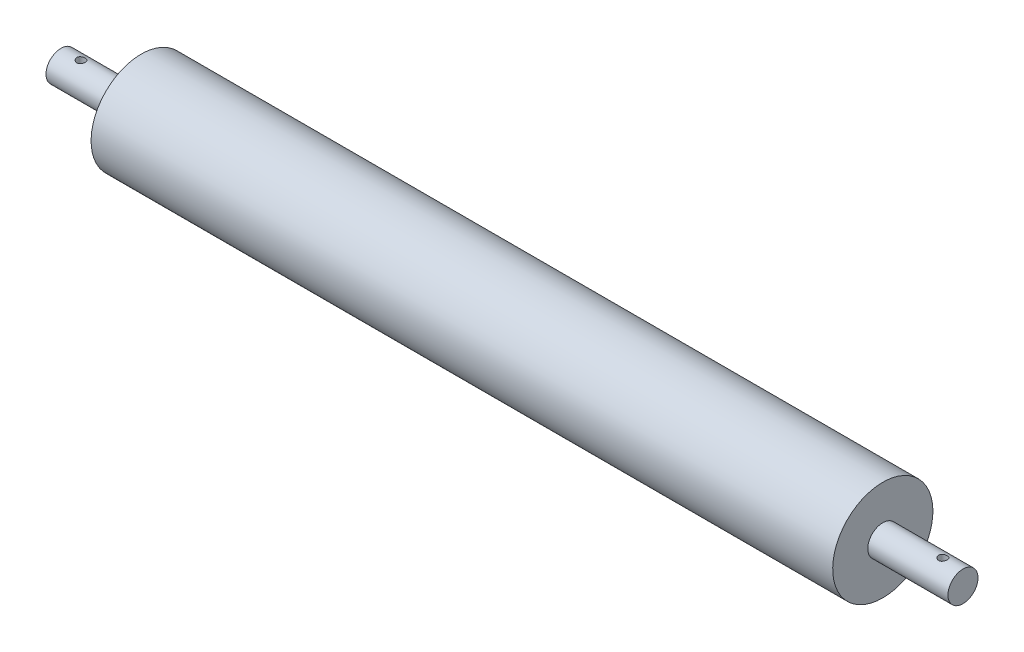
ISO-10303-21;
HEADER;
FILE_DESCRIPTION(('STEP AP214'),'2;1');
FILE_NAME('part.step','',(''),(''),'','','');
FILE_SCHEMA(('AUTOMOTIVE_DESIGN { 1 0 10303 214 1 1 1 1 }'));
ENDSEC;
DATA;
#1=APPLICATION_CONTEXT('core data for automotive mechanical design processes');
#2=APPLICATION_PROTOCOL_DEFINITION('international standard','automotive_design',2000,#1);
#3=PRODUCT_CONTEXT('',#1,'mechanical');
#4=PRODUCT('Part','Part','',(#3));
#5=PRODUCT_RELATED_PRODUCT_CATEGORY('part','',(#4));
#6=PRODUCT_DEFINITION_FORMATION('','',#4);
#7=PRODUCT_DEFINITION_CONTEXT('part definition',#1,'design');
#8=PRODUCT_DEFINITION('design','',#6,#7);
#9=PRODUCT_DEFINITION_SHAPE('','',#8);
#10=(LENGTH_UNIT() NAMED_UNIT(*) SI_UNIT(.MILLI.,.METRE.));
#11=(NAMED_UNIT(*) PLANE_ANGLE_UNIT() SI_UNIT($,.RADIAN.));
#12=(NAMED_UNIT(*) SI_UNIT($,.STERADIAN.) SOLID_ANGLE_UNIT());
#13=UNCERTAINTY_MEASURE_WITH_UNIT(LENGTH_MEASURE(1.E-05),#10,'distance_accuracy_value','');
#14=(GEOMETRIC_REPRESENTATION_CONTEXT(3) GLOBAL_UNCERTAINTY_ASSIGNED_CONTEXT((#13)) GLOBAL_UNIT_ASSIGNED_CONTEXT((#10,
#11,#12)) REPRESENTATION_CONTEXT('',''));
#15=CARTESIAN_POINT('',(0.,0.,0.));
#16=DIRECTION('',(0.,0.,1.));
#17=DIRECTION('',(1.,0.,0.));
#18=AXIS2_PLACEMENT_3D('',#15,#16,#17);
#19=CARTESIAN_POINT('',(-225.,0.,0.));
#20=DIRECTION('',(-1.,0.,0.));
#21=DIRECTION('',(0.,-1.,0.));
#22=AXIS2_PLACEMENT_3D('',#19,#20,#21);
#23=CYLINDRICAL_SURFACE('',#22,7.50000000000005);
#24=CARTESIAN_POINT('',(-212.9,-7.50000000000011,0.));
#25=CARTESIAN_POINT('',(-212.900002265932,-7.49999850044554,-0.115549071859457));
#26=CARTESIAN_POINT('',(-212.909568701615,-7.49730368858131,-0.231121705110066));
#27=CARTESIAN_POINT('',(-212.947505082606,-7.4868158263675,-0.45892349563475));
#28=CARTESIAN_POINT('',(-212.975882733424,-7.47902068682232,-0.571151263080411));
#29=CARTESIAN_POINT('',(-213.050435979883,-7.45919014801406,-0.788943238195502));
#30=CARTESIAN_POINT('',(-213.096587328513,-7.44716052737571,-0.894516296930381));
#31=CARTESIAN_POINT('',(-213.205284268175,-7.4201241503911,-1.09642476541401));
#32=CARTESIAN_POINT('',(-213.267831387487,-7.40511711654656,-1.19275931288064));
#33=CARTESIAN_POINT('',(-213.40921685869,-7.37331332850805,-1.37589761639295));
#34=CARTESIAN_POINT('',(-213.48839417191,-7.35648356700862,-1.46243395483418));
#35=CARTESIAN_POINT('',(-213.660068766112,-7.32313712362275,-1.62118994975328));
#36=CARTESIAN_POINT('',(-213.752567951364,-7.30662048687797,-1.69340755595235));
#37=CARTESIAN_POINT('',(-213.950444488171,-7.27542837897233,-1.82281954418508));
#38=CARTESIAN_POINT('',(-214.056034894758,-7.26079431852533,-1.87969906189856));
#39=CARTESIAN_POINT('',(-214.275756949843,-7.23551274440873,-1.97478943248911));
#40=CARTESIAN_POINT('',(-214.389886836729,-7.22486441122804,-2.01300412356117));
#41=CARTESIAN_POINT('',(-214.620469828537,-7.20910195955097,-2.06873752873863));
#42=CARTESIAN_POINT('',(-214.736795828738,-7.20385758469805,-2.08674433574881));
#43=CARTESIAN_POINT('',(-214.970926755648,-7.19910829329393,-2.10307354988687));
#44=CARTESIAN_POINT('',(-215.08873136992,-7.19960218395822,-2.10140004786117));
#45=CARTESIAN_POINT('',(-215.318605561201,-7.20615747477856,-2.07880203719542));
#46=CARTESIAN_POINT('',(-215.430739706368,-7.21204577982261,-2.05847601372619));
#47=CARTESIAN_POINT('',(-215.649938535122,-7.22844816907833,-2.0001117380616));
#48=CARTESIAN_POINT('',(-215.757002775789,-7.2389626566229,-1.96207194147719));
#49=CARTESIAN_POINT('',(-215.964545229844,-7.26357938222872,-1.86889065894201));
#50=CARTESIAN_POINT('',(-216.064926763074,-7.27772396889451,-1.81354549979213));
#51=CARTESIAN_POINT('',(-216.255184393326,-7.30798533076015,-1.68746638599932));
#52=CARTESIAN_POINT('',(-216.345058227229,-7.32410252929108,-1.61672912560206));
#53=CARTESIAN_POINT('',(-216.515159392371,-7.35720651544567,-1.45884755286447));
#54=CARTESIAN_POINT('',(-216.594920991732,-7.37420368441491,-1.37120287335204));
#55=CARTESIAN_POINT('',(-216.73871469503,-7.40663279030209,-1.18357169751813));
#56=CARTESIAN_POINT('',(-216.802746046709,-7.42206465234263,-1.08358461129687));
#57=CARTESIAN_POINT('',(-216.913496191882,-7.44973605200337,-0.873337450332554));
#58=CARTESIAN_POINT('',(-216.960123372682,-7.4619585991163,-0.763026733669732));
#59=CARTESIAN_POINT('',(-217.034032661246,-7.48171171416268,-0.535710183719804));
#60=CARTESIAN_POINT('',(-217.061319445106,-7.48924341618894,-0.418705976174556));
#61=CARTESIAN_POINT('',(-217.095025123087,-7.49859164706711,-0.185292401498512));
#62=CARTESIAN_POINT('',(-217.102076408542,-7.50058131296805,-0.0689811489871551));
#63=CARTESIAN_POINT('',(-217.096867443294,-7.49912299982246,0.163164639318449));
#64=CARTESIAN_POINT('',(-217.084609410336,-7.49567564523723,0.278999228327256));
#65=CARTESIAN_POINT('',(-217.041645897512,-7.48384311833665,0.504596268732437));
#66=CARTESIAN_POINT('',(-217.011299647587,-7.47555416236058,0.614432648474346));
#67=CARTESIAN_POINT('',(-216.933444075017,-7.4549851125705,0.827440079594221));
#68=CARTESIAN_POINT('',(-216.885932802633,-7.44270456537575,0.930610372215065));
#69=CARTESIAN_POINT('',(-216.773966485027,-7.41511700690716,1.12976408663138));
#70=CARTESIAN_POINT('',(-216.709176008197,-7.39975176074424,1.22555065053479));
#71=CARTESIAN_POINT('',(-216.564906489663,-7.36776719837975,1.40511158541059));
#72=CARTESIAN_POINT('',(-216.485424240599,-7.35114760881216,1.48888332632157));
#73=CARTESIAN_POINT('',(-216.311066544101,-7.31787944351917,1.64474908309544));
#74=CARTESIAN_POINT('',(-216.215786952467,-7.30124626249013,1.71639518266253));
#75=CARTESIAN_POINT('',(-216.014200243831,-7.27039890541735,1.84269980125679));
#76=CARTESIAN_POINT('',(-215.907893539075,-7.25618463899522,1.89735895503361));
#77=CARTESIAN_POINT('',(-215.687743301334,-7.23195038062162,1.98773352270874));
#78=CARTESIAN_POINT('',(-215.573945104113,-7.22190744096211,2.0235528782643));
#79=CARTESIAN_POINT('',(-215.341606782674,-7.20716859474255,2.07544269963815));
#80=CARTESIAN_POINT('',(-215.223068034976,-7.20247114750873,2.09151885593221));
#81=CARTESIAN_POINT('',(-214.98922436315,-7.19909300510946,2.103114655158));
#82=CARTESIAN_POINT('',(-214.873957874357,-7.20020048759666,2.09935796340977));
#83=CARTESIAN_POINT('',(-214.645772102506,-7.20780629176393,2.07309224060163));
#84=CARTESIAN_POINT('',(-214.532852746951,-7.21430444668282,2.05058378962983));
#85=CARTESIAN_POINT('',(-214.313582306345,-7.23182691657997,1.98789228158043));
#86=CARTESIAN_POINT('',(-214.207179451938,-7.24280810607189,1.94787737568999));
#87=CARTESIAN_POINT('',(-214.00251439703,-7.26805665519039,1.85143886377056));
#88=CARTESIAN_POINT('',(-213.904253592587,-7.28232457679056,1.79501245122783));
#89=CARTESIAN_POINT('',(-213.715244408188,-7.31311239075342,1.66522213518896));
#90=CARTESIAN_POINT('',(-213.624839592268,-7.32968998213815,1.59137155804019));
#91=CARTESIAN_POINT('',(-213.457470933722,-7.36292421204924,1.42973554613915));
#92=CARTESIAN_POINT('',(-213.380510442848,-7.37958086922708,1.3419466468612));
#93=CARTESIAN_POINT('',(-213.240364820534,-7.41158138369401,1.15235163570582));
#94=CARTESIAN_POINT('',(-213.177560154721,-7.42688347042859,1.05025658819516));
#95=CARTESIAN_POINT('',(-213.070102083336,-7.45397802038311,0.836529392791815));
#96=CARTESIAN_POINT('',(-213.02543822038,-7.46577250453018,0.724902784475287));
#97=CARTESIAN_POINT('',(-212.960661009321,-7.48318647397423,0.511578272572154));
#98=CARTESIAN_POINT('',(-212.937969244407,-7.48944328125714,0.410708274492533));
#99=CARTESIAN_POINT('',(-212.907638647024,-7.49785046352118,0.206564929983068));
#100=CARTESIAN_POINT('',(-212.899997974433,-7.5000013404852,0.10329187890855));
#101=CARTESIAN_POINT('',(-212.9,-7.50000000000011,0.));
#102=B_SPLINE_CURVE_WITH_KNOTS('',3,(#24,#25,#26,#27,#28,#29,#30,#31,#32,#33,#34,#35,#36,#37,
#38,#39,#40,#41,#42,#43,#44,#45,#46,#47,#48,#49,#50,#51,#52,#53,#54,#55,#56,#57,#58,#59,#60,#61,
#62,#63,#64,#65,#66,#67,#68,#69,#70,#71,#72,#73,#74,#75,#76,#77,#78,#79,#80,#81,#82,#83,#84,#85,
#86,#87,#88,#89,#90,#91,#92,#93,#94,#95,#96,#97,#98,#99,#100,#101),.UNSPECIFIED.,.T.,.F.,(4,2,2,
2,2,2,2,2,2,2,2,2,2,2,2,2,2,2,2,2,2,2,2,2,2,2,2,2,2,2,2,2,2,2,2,2,2,2,4),(0.,0.346268182086729,
0.692678291376706,1.03861748991142,1.38458894553261,1.7384494699132,2.09236062654245,
2.45306282264885,2.81369081346567,3.165407138292,3.51705035491517,3.85779089256616,
4.19856114350903,4.54350342442872,4.88851986168953,5.24599927407035,5.60349577863914,
5.96284840125165,6.32211411040286,6.67002301614659,7.01789196621452,7.35907226789233,
7.70029133572953,8.04868889915353,8.39716261126658,8.75655041081177,9.11592477953092,
9.47329506480391,9.83056232297602,10.1748857034314,10.5191984325935,10.8602742217546,
11.2014083722408,11.5535216990376,11.9057226849497,12.2664877844676,12.627044622426,
12.9366192831129,13.2461560933912),.UNSPECIFIED.);
#103=CARTESIAN_POINT('',(-212.9,-7.50000000000011,0.));
#104=VERTEX_POINT('',#103);
#105=EDGE_CURVE('E56',#104,#104,#102,.T.);
#106=ORIENTED_EDGE('',*,*,#105,.T.);
#107=EDGE_LOOP('',(#106));
#108=FACE_BOUND('',#107,.T.);
#109=CARTESIAN_POINT('',(-215.,7.20000000000001,-2.09999999999998));
#110=CARTESIAN_POINT('',(-214.884551105171,7.20000175092611,-2.09999769142369));
#111=CARTESIAN_POINT('',(-214.769078575321,7.20280713265304,-2.09044725800798));
#112=CARTESIAN_POINT('',(-214.54148428755,7.21368770991474,-2.05258019102822));
#113=CARTESIAN_POINT('',(-214.429364011186,7.22176520052276,-2.02425538445369));
#114=CARTESIAN_POINT('',(-214.211800239884,7.24220502233454,-1.9498565203188));
#115=CARTESIAN_POINT('',(-214.106346976187,7.25456090412265,-1.90380916683964));
#116=CARTESIAN_POINT('',(-213.904642076066,7.28215690109495,-1.79535769220002));
#117=CARTESIAN_POINT('',(-213.808391419824,7.29739732300138,-1.73295183131603));
#118=CARTESIAN_POINT('',(-213.625170524164,7.32951618449188,-1.59171413202464));
#119=CARTESIAN_POINT('',(-213.538491554078,7.3464259933653,-1.51251149606309));
#120=CARTESIAN_POINT('',(-213.379456847992,7.37970866753021,-1.34072490285873));
#121=CARTESIAN_POINT('',(-213.307102728488,7.39608147204939,-1.24813943745965));
#122=CARTESIAN_POINT('',(-213.177537651625,7.42679785762245,-1.05017536418179));
#123=CARTESIAN_POINT('',(-213.12061913539,7.44110013563313,-0.944598390212231));
#124=CARTESIAN_POINT('',(-213.025453091768,7.46570231446394,-0.724904746771338));
#125=CARTESIAN_POINT('',(-212.987202079501,7.4760029622418,-0.610789675797211));
#126=CARTESIAN_POINT('',(-212.931407724742,7.49121941354851,-0.380302236373013));
#127=CARTESIAN_POINT('',(-212.913368239384,7.49626401123117,-0.264058623362744));
#128=CARTESIAN_POINT('',(-212.896945021266,7.50085154395726,-0.0300927460087981));
#129=CARTESIAN_POINT('',(-212.898557674752,7.50039549049382,0.0876292425050895));
#130=CARTESIAN_POINT('',(-212.92104988332,7.49412619131461,0.317746311518642));
#131=CARTESIAN_POINT('',(-212.941392939667,7.48846212582118,0.430198522887043));
#132=CARTESIAN_POINT('',(-212.999898039308,7.47259127690994,0.650024177765268));
#133=CARTESIAN_POINT('',(-213.038061147435,7.4623842220287,0.757397317354186));
#134=CARTESIAN_POINT('',(-213.131515393555,7.43835884069074,0.965349801263539));
#135=CARTESIAN_POINT('',(-213.186984449305,7.42450324668395,1.06584470618677));
#136=CARTESIAN_POINT('',(-213.313337959938,7.39466485562083,1.2562786245792));
#137=CARTESIAN_POINT('',(-213.384225680743,7.37868160817165,1.34621539544037));
#138=CARTESIAN_POINT('',(-213.542227543553,7.34567522057905,1.51618305590155));
#139=CARTESIAN_POINT('',(-213.629808584103,7.32863518998309,1.59577717509014));
#140=CARTESIAN_POINT('',(-213.817248686452,7.29591665217891,1.73926156835207));
#141=CARTESIAN_POINT('',(-213.917108663539,7.28023824661686,1.80315067068667));
#142=CARTESIAN_POINT('',(-214.127296669996,7.25194501002576,1.9137903023159));
#143=CARTESIAN_POINT('',(-214.237696705722,7.23935371206725,1.96041048527217));
#144=CARTESIAN_POINT('',(-214.465210552784,7.21894665875122,2.03427979371575));
#145=CARTESIAN_POINT('',(-214.582322490633,7.21112957780356,2.0615342965447));
#146=CARTESIAN_POINT('',(-214.815822653963,7.20144181427927,2.0951213370356));
#147=CARTESIAN_POINT('',(-214.93210882732,7.19938465899453,2.10211023295228));
#148=CARTESIAN_POINT('',(-215.164190679021,7.20093733719562,2.09678562260949));
#149=CARTESIAN_POINT('',(-215.279986414098,7.20454649620962,2.08447441367737));
#150=CARTESIAN_POINT('',(-215.505192111961,7.21684386770043,2.04148011473317));
#151=CARTESIAN_POINT('',(-215.614686177437,7.22541993924817,2.01120230768186));
#152=CARTESIAN_POINT('',(-215.827038759286,7.24657269498034,1.93359543214542));
#153=CARTESIAN_POINT('',(-215.929896342924,7.2591499400491,1.88626397295674));
#154=CARTESIAN_POINT('',(-216.128772697618,7.28726240690147,1.77459509136295));
#155=CARTESIAN_POINT('',(-216.224569166007,7.30286116048027,1.7098781350204));
#156=CARTESIAN_POINT('',(-216.404183146438,7.33511474861878,1.56573803326783));
#157=CARTESIAN_POINT('',(-216.48799816133,7.35176980228926,1.48631183008105));
#158=CARTESIAN_POINT('',(-216.644050836574,7.38490975407121,1.31195238316688));
#159=CARTESIAN_POINT('',(-216.715827769497,7.4013718288206,1.21660153256647));
#160=CARTESIAN_POINT('',(-216.842362955699,7.43172364179825,1.01482822512431));
#161=CARTESIAN_POINT('',(-216.897122108126,7.44561351591507,0.908406353625252));
#162=CARTESIAN_POINT('',(-216.987549235114,7.46916678636433,0.688255620931217));
#163=CARTESIAN_POINT('',(-217.023361596398,7.47886204186584,0.574589642969954));
#164=CARTESIAN_POINT('',(-217.075281788541,7.4930742926061,0.342537614831916));
#165=CARTESIAN_POINT('',(-217.091394471009,7.49759256280785,0.224152734238785));
#166=CARTESIAN_POINT('',(-217.10312839472,7.50087475153957,-0.00969112124069943));
#167=CARTESIAN_POINT('',(-217.099422304045,7.49982757425403,-0.125114144970984));
#168=CARTESIAN_POINT('',(-217.073203611385,7.49253071356722,-0.353626881036647));
#169=CARTESIAN_POINT('',(-217.050691848555,7.48628126230442,-0.46671669725483));
#170=CARTESIAN_POINT('',(-216.987896139583,7.46932613881606,-0.686456269375127));
#171=CARTESIAN_POINT('',(-216.947760954317,7.4586578085919,-0.793151611784442));
#172=CARTESIAN_POINT('',(-216.8509899872,7.43397489084363,-0.998353701041703));
#173=CARTESIAN_POINT('',(-216.794351719446,7.41995979924538,-1.09685921135805));
#174=CARTESIAN_POINT('',(-216.664283001771,7.38956927564246,-1.28596610763474));
#175=CARTESIAN_POINT('',(-216.59041564695,7.37313745973982,-1.37625788128735));
#176=CARTESIAN_POINT('',(-216.42879782154,7.3399740390093,-1.54339107601338));
#177=CARTESIAN_POINT('',(-216.341043575182,7.32324235374893,-1.62022882700917));
#178=CARTESIAN_POINT('',(-216.151512877718,7.29088892650895,-1.76018100811377));
#179=CARTESIAN_POINT('',(-216.04944137268,7.27530525828304,-1.82290552428639));
#180=CARTESIAN_POINT('',(-215.835778008759,7.24757503896699,-1.93021956053792));
#181=CARTESIAN_POINT('',(-215.724191806851,7.23542646383002,-1.97481976673696));
#182=CARTESIAN_POINT('',(-215.511017150351,7.21744457121271,-2.03947300884318));
#183=CARTESIAN_POINT('',(-215.410261761127,7.21095909202013,-2.06211391312518));
#184=CARTESIAN_POINT('',(-215.206343642914,7.20223632826998,-2.09237736458969));
#185=CARTESIAN_POINT('',(-215.103181260938,7.19999843512783,-2.10000206326625));
#186=CARTESIAN_POINT('',(-215.,7.20000000000001,-2.09999999999998));
#187=B_SPLINE_CURVE_WITH_KNOTS('',3,(#109,#110,#111,#112,#113,#114,#115,#116,#117,#118,#119,
#120,#121,#122,#123,#124,#125,#126,#127,#128,#129,#130,#131,#132,#133,#134,#135,#136,#137,#138,
#139,#140,#141,#142,#143,#144,#145,#146,#147,#148,#149,#150,#151,#152,#153,#154,#155,#156,#157,
#158,#159,#160,#161,#162,#163,#164,#165,#166,#167,#168,#169,#170,#171,#172,#173,#174,#175,#176,
#177,#178,#179,#180,#181,#182,#183,#184,#185,#186),.UNSPECIFIED.,.T.,.F.,(4,2,2,2,2,2,2,2,2,2,2,
2,2,2,2,2,2,2,2,2,2,2,2,2,2,2,2,2,2,2,2,2,2,2,2,2,2,2,4),(0.,0.345966820679471,
0.692084349409676,1.03768238213022,1.3833171840449,1.73757082880147,2.09186442676817,
2.45246381411616,2.81299585839307,3.16446935825169,3.51587822801509,3.85752460211592,
4.19919139381875,4.54449343533438,4.8898686887804,5.24690042870958,5.60395879841148,
5.96365984094946,6.32326096486549,6.67107770948498,7.0188530559746,7.35906666926097,
7.699327994706,8.04772451120087,8.39619353426622,8.75590447674838,9.1155964103904,
9.47250627059269,9.82932821384829,10.1741178008123,10.5188920032276,10.8608102624592,
11.202780052397,11.5546053491271,11.9065264700836,12.267221716464,12.627703986753,
12.9369525819905,13.2461568654393),.UNSPECIFIED.);
#188=CARTESIAN_POINT('',(-215.,7.20000000000001,-2.09999999999998));
#189=VERTEX_POINT('',#188);
#190=EDGE_CURVE('E74',#189,#189,#187,.T.);
#191=ORIENTED_EDGE('',*,*,#190,.T.);
#192=EDGE_LOOP('',(#191));
#193=FACE_BOUND('',#192,.T.);
#194=CARTESIAN_POINT('',(-225.,0.,0.));
#195=DIRECTION('',(-1.,0.,0.));
#196=DIRECTION('',(0.,-1.,0.));
#197=AXIS2_PLACEMENT_3D('',#194,#195,#196);
#198=CIRCLE('',#197,7.50000000000006);
#199=CARTESIAN_POINT('',(-225.,-7.50000000000011,0.));
#200=VERTEX_POINT('',#199);
#201=EDGE_CURVE('E134',#200,#200,#198,.T.);
#202=ORIENTED_EDGE('',*,*,#201,.F.);
#203=EDGE_LOOP('',(#202));
#204=FACE_BOUND('',#203,.T.);
#205=CARTESIAN_POINT('',(-185.,0.,0.));
#206=DIRECTION('',(-1.,0.,0.));
#207=DIRECTION('',(0.,-1.,0.));
#208=AXIS2_PLACEMENT_3D('',#205,#206,#207);
#209=CIRCLE('',#208,7.50000000000005);
#210=CARTESIAN_POINT('',(-185.,-7.5000000000001,0.));
#211=VERTEX_POINT('',#210);
#212=EDGE_CURVE('E61',#211,#211,#209,.T.);
#213=ORIENTED_EDGE('',*,*,#212,.T.);
#214=EDGE_LOOP('',(#213));
#215=FACE_BOUND('',#214,.T.);
#216=ADVANCED_FACE('F43',(#108,#193,#204,#215),#23,.T.);
#217=CARTESIAN_POINT('',(-185.,25.,0.));
#218=DIRECTION('',(1.,0.,0.));
#219=DIRECTION('',(0.,1.,0.));
#220=AXIS2_PLACEMENT_3D('',#217,#218,#219);
#221=PLANE('',#220);
#222=ORIENTED_EDGE('',*,*,#212,.F.);
#223=EDGE_LOOP('',(#222));
#224=FACE_BOUND('',#223,.T.);
#225=CARTESIAN_POINT('',(-185.,0.,0.));
#226=DIRECTION('',(-1.,0.,0.));
#227=DIRECTION('',(0.,-1.,0.));
#228=AXIS2_PLACEMENT_3D('',#225,#226,#227);
#229=CIRCLE('',#228,25.0000000000001);
#230=CARTESIAN_POINT('',(-185.,-25.0000000000001,0.));
#231=VERTEX_POINT('',#230);
#232=EDGE_CURVE('E67',#231,#231,#229,.T.);
#233=ORIENTED_EDGE('',*,*,#232,.T.);
#234=EDGE_LOOP('',(#233));
#235=FACE_BOUND('',#234,.T.);
#236=ADVANCED_FACE('F108',(#224,#235),#221,.F.);
#237=CARTESIAN_POINT('',(-225.,0.,0.));
#238=DIRECTION('',(-1.,0.,0.));
#239=DIRECTION('',(0.,-1.,0.));
#240=AXIS2_PLACEMENT_3D('',#237,#238,#239);
#241=CYLINDRICAL_SURFACE('',#240,25.);
#242=ORIENTED_EDGE('',*,*,#232,.F.);
#243=EDGE_LOOP('',(#242));
#244=FACE_BOUND('',#243,.T.);
#245=CARTESIAN_POINT('',(185.,0.,0.));
#246=DIRECTION('',(-1.,0.,0.));
#247=DIRECTION('',(0.,-1.,0.));
#248=AXIS2_PLACEMENT_3D('',#245,#246,#247);
#249=CIRCLE('',#248,25.);
#250=CARTESIAN_POINT('',(185.,-25.,0.));
#251=VERTEX_POINT('',#250);
#252=EDGE_CURVE('E120',#251,#251,#249,.T.);
#253=ORIENTED_EDGE('',*,*,#252,.T.);
#254=EDGE_LOOP('',(#253));
#255=FACE_BOUND('',#254,.T.);
#256=ADVANCED_FACE('F105',(#244,#255),#241,.T.);
#257=CARTESIAN_POINT('',(185.,25.,0.));
#258=DIRECTION('',(-1.,0.,0.));
#259=DIRECTION('',(0.,-1.,0.));
#260=AXIS2_PLACEMENT_3D('',#257,#258,#259);
#261=PLANE('',#260);
#262=ORIENTED_EDGE('',*,*,#252,.F.);
#263=EDGE_LOOP('',(#262));
#264=FACE_BOUND('',#263,.T.);
#265=CARTESIAN_POINT('',(185.,0.,0.));
#266=DIRECTION('',(-1.,0.,0.));
#267=DIRECTION('',(0.,-1.,0.));
#268=AXIS2_PLACEMENT_3D('',#265,#266,#267);
#269=CIRCLE('',#268,7.50000000000001);
#270=CARTESIAN_POINT('',(185.,-7.50000000000001,0.));
#271=VERTEX_POINT('',#270);
#272=EDGE_CURVE('E124',#271,#271,#269,.T.);
#273=ORIENTED_EDGE('',*,*,#272,.T.);
#274=EDGE_LOOP('',(#273));
#275=FACE_BOUND('',#274,.T.);
#276=ADVANCED_FACE('F101',(#264,#275),#261,.F.);
#277=CARTESIAN_POINT('',(-225.,0.,0.));
#278=DIRECTION('',(-1.,0.,0.));
#279=DIRECTION('',(0.,-1.,0.));
#280=AXIS2_PLACEMENT_3D('',#277,#278,#279);
#281=CYLINDRICAL_SURFACE('',#280,7.50000000000003);
#282=CARTESIAN_POINT('',(217.1,-7.50000000000003,0.));
#283=CARTESIAN_POINT('',(217.099997734068,-7.49999850044547,-0.115549071859457));
#284=CARTESIAN_POINT('',(217.090431298385,-7.49730368858123,-0.231121705110066));
#285=CARTESIAN_POINT('',(217.052494917394,-7.48681582636743,-0.45892349563475));
#286=CARTESIAN_POINT('',(217.024117266576,-7.47902068682225,-0.571151263080411));
#287=CARTESIAN_POINT('',(216.949564020117,-7.45919014801399,-0.788943238195502));
#288=CARTESIAN_POINT('',(216.903412671487,-7.44716052737563,-0.89451629693038));
#289=CARTESIAN_POINT('',(216.794715731825,-7.42012415039103,-1.09642476541401));
#290=CARTESIAN_POINT('',(216.732168612513,-7.40511711654648,-1.19275931288064));
#291=CARTESIAN_POINT('',(216.59078314131,-7.37331332850798,-1.37589761639295));
#292=CARTESIAN_POINT('',(216.51160582809,-7.35648356700855,-1.46243395483418));
#293=CARTESIAN_POINT('',(216.339931233888,-7.32313712362267,-1.62118994975328));
#294=CARTESIAN_POINT('',(216.247432048636,-7.30662048687789,-1.69340755595235));
#295=CARTESIAN_POINT('',(216.049555511829,-7.27542837897225,-1.82281954418508));
#296=CARTESIAN_POINT('',(215.943965105242,-7.26079431852525,-1.87969906189856));
#297=CARTESIAN_POINT('',(215.724243050157,-7.23551274440866,-1.97478943248911));
#298=CARTESIAN_POINT('',(215.610113163271,-7.22486441122796,-2.01300412356117));
#299=CARTESIAN_POINT('',(215.379530171463,-7.20910195955089,-2.06873752873863));
#300=CARTESIAN_POINT('',(215.263204171262,-7.20385758469797,-2.08674433574881));
#301=CARTESIAN_POINT('',(215.029073244352,-7.19910829329386,-2.10307354988687));
#302=CARTESIAN_POINT('',(214.91126863008,-7.19960218395814,-2.10140004786117));
#303=CARTESIAN_POINT('',(214.681394438799,-7.20615747477848,-2.07880203719542));
#304=CARTESIAN_POINT('',(214.569260293632,-7.21204577982253,-2.05847601372619));
#305=CARTESIAN_POINT('',(214.350061464878,-7.22844816907825,-2.0001117380616));
#306=CARTESIAN_POINT('',(214.242997224211,-7.23896265662282,-1.96207194147719));
#307=CARTESIAN_POINT('',(214.035454770156,-7.26357938222864,-1.86889065894201));
#308=CARTESIAN_POINT('',(213.935073236926,-7.27772396889443,-1.81354549979213));
#309=CARTESIAN_POINT('',(213.744815606674,-7.30798533076007,-1.68746638599933));
#310=CARTESIAN_POINT('',(213.654941772771,-7.32410252929101,-1.61672912560206));
#311=CARTESIAN_POINT('',(213.484840607629,-7.35720651544559,-1.45884755286447));
#312=CARTESIAN_POINT('',(213.405079008268,-7.37420368441483,-1.37120287335204));
#313=CARTESIAN_POINT('',(213.26128530497,-7.40663279030202,-1.18357169751813));
#314=CARTESIAN_POINT('',(213.197253953291,-7.42206465234255,-1.08358461129688));
#315=CARTESIAN_POINT('',(213.086503808118,-7.4497360520033,-0.87333745033256));
#316=CARTESIAN_POINT('',(213.039876627318,-7.46195859911622,-0.763026733669743));
#317=CARTESIAN_POINT('',(212.965967338754,-7.48171171416261,-0.535710183719823));
#318=CARTESIAN_POINT('',(212.938680554894,-7.48924341618886,-0.41870597617458));
#319=CARTESIAN_POINT('',(212.904974876913,-7.49859164706704,-0.185292401498535));
#320=CARTESIAN_POINT('',(212.897923591458,-7.50058131296797,-0.0689811489871725));
#321=CARTESIAN_POINT('',(212.903132556706,-7.49912299982238,0.163164639318441));
#322=CARTESIAN_POINT('',(212.915390589664,-7.49567564523715,0.278999228327252));
#323=CARTESIAN_POINT('',(212.958354102488,-7.48384311833657,0.504596268732447));
#324=CARTESIAN_POINT('',(212.988700352413,-7.47555416236051,0.614432648474365));
#325=CARTESIAN_POINT('',(213.066555924983,-7.45498511257042,0.827440079594238));
#326=CARTESIAN_POINT('',(213.114067197367,-7.44270456537568,0.930610372215072));
#327=CARTESIAN_POINT('',(213.226033514973,-7.41511700690709,1.12976408663138));
#328=CARTESIAN_POINT('',(213.290823991803,-7.39975176074416,1.22555065053479));
#329=CARTESIAN_POINT('',(213.435093510337,-7.36776719837967,1.40511158541059));
#330=CARTESIAN_POINT('',(213.514575759401,-7.35114760881209,1.48888332632156));
#331=CARTESIAN_POINT('',(213.688933455899,-7.31787944351909,1.64474908309543));
#332=CARTESIAN_POINT('',(213.784213047533,-7.30124626249006,1.71639518266252));
#333=CARTESIAN_POINT('',(213.985799756169,-7.27039890541727,1.84269980125679));
#334=CARTESIAN_POINT('',(214.092106460925,-7.25618463899515,1.89735895503361));
#335=CARTESIAN_POINT('',(214.312256698666,-7.23195038062154,1.98773352270874));
#336=CARTESIAN_POINT('',(214.426054895887,-7.22190744096203,2.0235528782643));
#337=CARTESIAN_POINT('',(214.658393217326,-7.20716859474247,2.07544269963815));
#338=CARTESIAN_POINT('',(214.776931965024,-7.20247114750865,2.09151885593221));
#339=CARTESIAN_POINT('',(215.01077563685,-7.19909300510939,2.103114655158));
#340=CARTESIAN_POINT('',(215.126042125643,-7.20020048759658,2.09935796340977));
#341=CARTESIAN_POINT('',(215.354227897494,-7.20780629176385,2.07309224060163));
#342=CARTESIAN_POINT('',(215.467147253049,-7.21430444668275,2.05058378962983));
#343=CARTESIAN_POINT('',(215.686417693655,-7.2318269165799,1.98789228158043));
#344=CARTESIAN_POINT('',(215.792820548062,-7.24280810607181,1.94787737568999));
#345=CARTESIAN_POINT('',(215.99748560297,-7.26805665519031,1.85143886377056));
#346=CARTESIAN_POINT('',(216.095746407413,-7.28232457679048,1.79501245122783));
#347=CARTESIAN_POINT('',(216.284755591812,-7.31311239075335,1.66522213518896));
#348=CARTESIAN_POINT('',(216.375160407732,-7.32968998213807,1.59137155804019));
#349=CARTESIAN_POINT('',(216.542529066278,-7.36292421204917,1.42973554613915));
#350=CARTESIAN_POINT('',(216.619489557152,-7.379580869227,1.3419466468612));
#351=CARTESIAN_POINT('',(216.759635179466,-7.41158138369394,1.15235163570582));
#352=CARTESIAN_POINT('',(216.822439845279,-7.42688347042852,1.05025658819516));
#353=CARTESIAN_POINT('',(216.929897916664,-7.45397802038304,0.836529392791816));
#354=CARTESIAN_POINT('',(216.97456177962,-7.4657725045301,0.724902784475288));
#355=CARTESIAN_POINT('',(217.039338990679,-7.48318647397415,0.511578272572155));
#356=CARTESIAN_POINT('',(217.062030755593,-7.48944328125707,0.410708274492533));
#357=CARTESIAN_POINT('',(217.092361352976,-7.49785046352111,0.206564929983068));
#358=CARTESIAN_POINT('',(217.100002025567,-7.50000134048513,0.10329187890855));
#359=CARTESIAN_POINT('',(217.1,-7.50000000000003,0.));
#360=B_SPLINE_CURVE_WITH_KNOTS('',3,(#282,#283,#284,#285,#286,#287,#288,#289,#290,#291,#292,
#293,#294,#295,#296,#297,#298,#299,#300,#301,#302,#303,#304,#305,#306,#307,#308,#309,#310,#311,
#312,#313,#314,#315,#316,#317,#318,#319,#320,#321,#322,#323,#324,#325,#326,#327,#328,#329,#330,
#331,#332,#333,#334,#335,#336,#337,#338,#339,#340,#341,#342,#343,#344,#345,#346,#347,#348,#349,
#350,#351,#352,#353,#354,#355,#356,#357,#358,#359),.UNSPECIFIED.,.T.,.F.,(4,2,2,2,2,2,2,2,2,2,2,
2,2,2,2,2,2,2,2,2,2,2,2,2,2,2,2,2,2,2,2,2,2,2,2,2,2,2,4),(0.,0.346268182086729,
0.692678291376706,1.03861748991142,1.38458894553261,1.7384494699132,2.09236062654245,
2.45306282264885,2.81369081346567,3.165407138292,3.51705035491517,3.85779089256616,
4.19856114350903,4.54350342442869,4.88851986168953,5.24599927407034,5.60349577863914,
5.96284840125162,6.32211411040283,6.67002301614657,7.01789196621452,7.35907226789235,
7.70029133572952,8.04868889915352,8.39716261126657,8.75655041081176,9.11592477953092,
9.4732950648039,9.83056232297602,10.1748857034314,10.5191984325935,10.8602742217546,
11.2014083722408,11.5535216990376,11.9057226849497,12.2664877844676,12.627044622426,
12.9366192831129,13.2461560933912),.UNSPECIFIED.);
#361=CARTESIAN_POINT('',(217.1,-7.50000000000003,0.));
#362=VERTEX_POINT('',#361);
#363=EDGE_CURVE('E10',#362,#362,#360,.T.);
#364=ORIENTED_EDGE('',*,*,#363,.T.);
#365=EDGE_LOOP('',(#364));
#366=FACE_BOUND('',#365,.T.);
#367=CARTESIAN_POINT('',(215.,7.20000000000004,-2.09999999999998));
#368=CARTESIAN_POINT('',(215.115448894829,7.20000175092614,-2.09999769142369));
#369=CARTESIAN_POINT('',(215.230921424679,7.20280713265307,-2.09044725800798));
#370=CARTESIAN_POINT('',(215.45851571245,7.21368770991477,-2.05258019102822));
#371=CARTESIAN_POINT('',(215.570635988814,7.22176520052279,-2.02425538445369));
#372=CARTESIAN_POINT('',(215.788199760116,7.24220502233456,-1.9498565203188));
#373=CARTESIAN_POINT('',(215.893653023813,7.25456090412268,-1.90380916683964));
#374=CARTESIAN_POINT('',(216.095357923934,7.28215690109498,-1.79535769220002));
#375=CARTESIAN_POINT('',(216.191608580176,7.29739732300141,-1.73295183131603));
#376=CARTESIAN_POINT('',(216.374829475836,7.32951618449191,-1.59171413202464));
#377=CARTESIAN_POINT('',(216.461508445922,7.34642599336533,-1.51251149606309));
#378=CARTESIAN_POINT('',(216.620543152008,7.37970866753024,-1.34072490285873));
#379=CARTESIAN_POINT('',(216.692897271512,7.39608147204942,-1.24813943745965));
#380=CARTESIAN_POINT('',(216.822462348375,7.42679785762248,-1.05017536418179));
#381=CARTESIAN_POINT('',(216.87938086461,7.44110013563316,-0.944598390212231));
#382=CARTESIAN_POINT('',(216.974546908232,7.46570231446397,-0.724904746771338));
#383=CARTESIAN_POINT('',(217.012797920499,7.47600296224183,-0.610789675797211));
#384=CARTESIAN_POINT('',(217.068592275258,7.49121941354854,-0.380302236373013));
#385=CARTESIAN_POINT('',(217.086631760616,7.49626401123119,-0.264058623362744));
#386=CARTESIAN_POINT('',(217.103054978734,7.50085154395729,-0.0300927460087985));
#387=CARTESIAN_POINT('',(217.101442325248,7.50039549049385,0.087629242505089));
#388=CARTESIAN_POINT('',(217.07895011668,7.49412619131464,0.317746311518641));
#389=CARTESIAN_POINT('',(217.058607060333,7.48846212582121,0.430198522887042));
#390=CARTESIAN_POINT('',(217.000101960692,7.47259127690997,0.650024177765267));
#391=CARTESIAN_POINT('',(216.961938852565,7.46238422202873,0.757397317354185));
#392=CARTESIAN_POINT('',(216.868484606445,7.43835884069077,0.965349801263538));
#393=CARTESIAN_POINT('',(216.813015550695,7.42450324668398,1.06584470618677));
#394=CARTESIAN_POINT('',(216.686662040062,7.39466485562086,1.2562786245792));
#395=CARTESIAN_POINT('',(216.615774319257,7.37868160817168,1.34621539544037));
#396=CARTESIAN_POINT('',(216.457772456447,7.34567522057908,1.51618305590155));
#397=CARTESIAN_POINT('',(216.370191415897,7.32863518998311,1.59577717509014));
#398=CARTESIAN_POINT('',(216.182751313548,7.29591665217894,1.73926156835207));
#399=CARTESIAN_POINT('',(216.082891336461,7.28023824661689,1.80315067068667));
#400=CARTESIAN_POINT('',(215.872703330004,7.25194501002579,1.9137903023159));
#401=CARTESIAN_POINT('',(215.762303294278,7.23935371206728,1.96041048527217));
#402=CARTESIAN_POINT('',(215.534789447216,7.21894665875125,2.03427979371575));
#403=CARTESIAN_POINT('',(215.417677509367,7.21112957780359,2.0615342965447));
#404=CARTESIAN_POINT('',(215.184177346037,7.2014418142793,2.0951213370356));
#405=CARTESIAN_POINT('',(215.06789117268,7.19938465899456,2.10211023295227));
#406=CARTESIAN_POINT('',(214.835809320979,7.20093733719565,2.09678562260949));
#407=CARTESIAN_POINT('',(214.720013585902,7.20454649620964,2.08447441367737));
#408=CARTESIAN_POINT('',(214.494807888039,7.21684386770046,2.04148011473317));
#409=CARTESIAN_POINT('',(214.385313822563,7.2254199392482,2.01120230768186));
#410=CARTESIAN_POINT('',(214.172961240714,7.24657269498037,1.93359543214542));
#411=CARTESIAN_POINT('',(214.070103657076,7.25914994004913,1.88626397295674));
#412=CARTESIAN_POINT('',(213.871227302382,7.28726240690149,1.77459509136296));
#413=CARTESIAN_POINT('',(213.775430833993,7.30286116048029,1.70987813502042));
#414=CARTESIAN_POINT('',(213.595816853562,7.33511474861881,1.56573803326785));
#415=CARTESIAN_POINT('',(213.51200183867,7.35176980228929,1.48631183008106));
#416=CARTESIAN_POINT('',(213.355949163426,7.38490975407124,1.31195238316688));
#417=CARTESIAN_POINT('',(213.284172230503,7.40137182882063,1.21660153256648));
#418=CARTESIAN_POINT('',(213.157637044301,7.43172364179828,1.01482822512432));
#419=CARTESIAN_POINT('',(213.102877891874,7.4456135159151,0.908406353625256));
#420=CARTESIAN_POINT('',(213.012450764886,7.46916678636436,0.688255620931216));
#421=CARTESIAN_POINT('',(212.976638403602,7.47886204186587,0.574589642969955));
#422=CARTESIAN_POINT('',(212.924718211459,7.49307429260613,0.342537614831916));
#423=CARTESIAN_POINT('',(212.908605528991,7.49759256280788,0.224152734238785));
#424=CARTESIAN_POINT('',(212.89687160528,7.5008747515396,-0.00969112124070149));
#425=CARTESIAN_POINT('',(212.900577695955,7.49982757425406,-0.125114144970989));
#426=CARTESIAN_POINT('',(212.926796388615,7.49253071356725,-0.353626881036651));
#427=CARTESIAN_POINT('',(212.949308151445,7.48628126230445,-0.466716697254831));
#428=CARTESIAN_POINT('',(213.012103860417,7.46932613881609,-0.686456269375126));
#429=CARTESIAN_POINT('',(213.052239045683,7.45865780859193,-0.793151611784441));
#430=CARTESIAN_POINT('',(213.1490100128,7.43397489084366,-0.998353701041702));
#431=CARTESIAN_POINT('',(213.205648280554,7.41995979924542,-1.09685921135805));
#432=CARTESIAN_POINT('',(213.335716998229,7.38956927564249,-1.28596610763474));
#433=CARTESIAN_POINT('',(213.40958435305,7.37313745973985,-1.37625788128735));
#434=CARTESIAN_POINT('',(213.57120217846,7.33997403900933,-1.54339107601338));
#435=CARTESIAN_POINT('',(213.658956424818,7.32324235374896,-1.62022882700917));
#436=CARTESIAN_POINT('',(213.848487122282,7.29088892650898,-1.76018100811378));
#437=CARTESIAN_POINT('',(213.95055862732,7.27530525828307,-1.8229055242864));
#438=CARTESIAN_POINT('',(214.164221991241,7.24757503896702,-1.93021956053792));
#439=CARTESIAN_POINT('',(214.275808193149,7.23542646383005,-1.97481976673696));
#440=CARTESIAN_POINT('',(214.488982849649,7.21744457121274,-2.03947300884318));
#441=CARTESIAN_POINT('',(214.589738238873,7.21095909202017,-2.06211391312517));
#442=CARTESIAN_POINT('',(214.793656357086,7.20223632827001,-2.09237736458969));
#443=CARTESIAN_POINT('',(214.896818739062,7.19999843512786,-2.10000206326625));
#444=CARTESIAN_POINT('',(215.,7.20000000000004,-2.09999999999998));
#445=B_SPLINE_CURVE_WITH_KNOTS('',3,(#367,#368,#369,#370,#371,#372,#373,#374,#375,#376,#377,
#378,#379,#380,#381,#382,#383,#384,#385,#386,#387,#388,#389,#390,#391,#392,#393,#394,#395,#396,
#397,#398,#399,#400,#401,#402,#403,#404,#405,#406,#407,#408,#409,#410,#411,#412,#413,#414,#415,
#416,#417,#418,#419,#420,#421,#422,#423,#424,#425,#426,#427,#428,#429,#430,#431,#432,#433,#434,
#435,#436,#437,#438,#439,#440,#441,#442,#443,#444),.UNSPECIFIED.,.T.,.F.,(4,2,2,2,2,2,2,2,2,2,2,
2,2,2,2,2,2,2,2,2,2,2,2,2,2,2,2,2,2,2,2,2,2,2,2,2,2,2,4),(0.,0.345966820679471,
0.692084349409676,1.03768238213022,1.3833171840449,1.73757082880147,2.09186442676817,
2.45246381411616,2.81299585839307,3.16446935825169,3.51587822801509,3.85752460211592,
4.19919139381875,4.54449343533438,4.88986868878039,5.24690042870957,5.60395879841148,
5.96365984094946,6.32326096486549,6.67107770948493,7.0188530559746,7.35906666926097,
7.699327994706,8.04772451120083,8.39619353426622,8.75590447674836,9.1155964103904,
9.47250627059269,9.82932821384829,10.1741178008123,10.5188920032276,10.8608102624592,
11.202780052397,11.5546053491271,11.9065264700836,12.267221716464,12.627703986753,
12.9369525819904,13.2461568654393),.UNSPECIFIED.);
#446=CARTESIAN_POINT('',(215.,7.20000000000004,-2.09999999999998));
#447=VERTEX_POINT('',#446);
#448=EDGE_CURVE('E78',#447,#447,#445,.T.);
#449=ORIENTED_EDGE('',*,*,#448,.T.);
#450=EDGE_LOOP('',(#449));
#451=FACE_BOUND('',#450,.T.);
#452=ORIENTED_EDGE('',*,*,#272,.F.);
#453=EDGE_LOOP('',(#452));
#454=FACE_BOUND('',#453,.T.);
#455=CARTESIAN_POINT('',(225.,0.,0.));
#456=DIRECTION('',(-1.,0.,0.));
#457=DIRECTION('',(0.,-1.,0.));
#458=AXIS2_PLACEMENT_3D('',#455,#456,#457);
#459=CIRCLE('',#458,7.50000000000006);
#460=CARTESIAN_POINT('',(225.,-7.50000000000006,0.));
#461=VERTEX_POINT('',#460);
#462=EDGE_CURVE('E130',#461,#461,#459,.T.);
#463=ORIENTED_EDGE('',*,*,#462,.T.);
#464=EDGE_LOOP('',(#463));
#465=FACE_BOUND('',#464,.T.);
#466=ADVANCED_FACE('F96',(#366,#451,#454,#465),#281,.T.);
#467=CARTESIAN_POINT('',(225.,0.,0.));
#468=DIRECTION('',(-1.,0.,0.));
#469=DIRECTION('',(0.,-1.,0.));
#470=AXIS2_PLACEMENT_3D('',#467,#468,#469);
#471=PLANE('',#470);
#472=ORIENTED_EDGE('',*,*,#462,.F.);
#473=EDGE_LOOP('',(#472));
#474=FACE_BOUND('',#473,.T.);
#475=ADVANCED_FACE('F93',(#474),#471,.F.);
#476=CARTESIAN_POINT('',(-225.,0.,0.));
#477=DIRECTION('',(1.,0.,0.));
#478=DIRECTION('',(0.,1.,0.));
#479=AXIS2_PLACEMENT_3D('',#476,#477,#478);
#480=PLANE('',#479);
#481=ORIENTED_EDGE('',*,*,#201,.T.);
#482=EDGE_LOOP('',(#481));
#483=FACE_BOUND('',#482,.T.);
#484=ADVANCED_FACE('F87',(#483),#480,.F.);
#485=CARTESIAN_POINT('',(-215.,-7.50000000000011,0.));
#486=DIRECTION('',(0.,-1.,0.));
#487=DIRECTION('',(0.,0.,-1.));
#488=AXIS2_PLACEMENT_3D('',#485,#486,#487);
#489=CYLINDRICAL_SURFACE('',#488,2.09999999999999);
#490=ORIENTED_EDGE('',*,*,#190,.F.);
#491=EDGE_LOOP('',(#490));
#492=FACE_BOUND('',#491,.T.);
#493=ORIENTED_EDGE('',*,*,#105,.F.);
#494=EDGE_LOOP('',(#493));
#495=FACE_BOUND('',#494,.T.);
#496=ADVANCED_FACE('F82',(#492,#495),#489,.F.);
#497=CARTESIAN_POINT('',(215.,-7.50000000000011,0.));
#498=DIRECTION('',(0.,-1.,0.));
#499=DIRECTION('',(0.,0.,-1.));
#500=AXIS2_PLACEMENT_3D('',#497,#498,#499);
#501=CYLINDRICAL_SURFACE('',#500,2.09999999999999);
#502=ORIENTED_EDGE('',*,*,#448,.F.);
#503=EDGE_LOOP('',(#502));
#504=FACE_BOUND('',#503,.T.);
#505=ORIENTED_EDGE('',*,*,#363,.F.);
#506=EDGE_LOOP('',(#505));
#507=FACE_BOUND('',#506,.T.);
#508=ADVANCED_FACE('F86',(#504,#507),#501,.F.);
#509=CLOSED_SHELL('',(#216,#236,#256,#276,#466,#475,#484,#496,#508));
#510=MANIFOLD_SOLID_BREP('B2',#509);
#511=ADVANCED_BREP_SHAPE_REPRESENTATION('',(#18,#510),#14);
#512=SHAPE_DEFINITION_REPRESENTATION(#9,#511);
ENDSEC;
END-ISO-10303-21;
